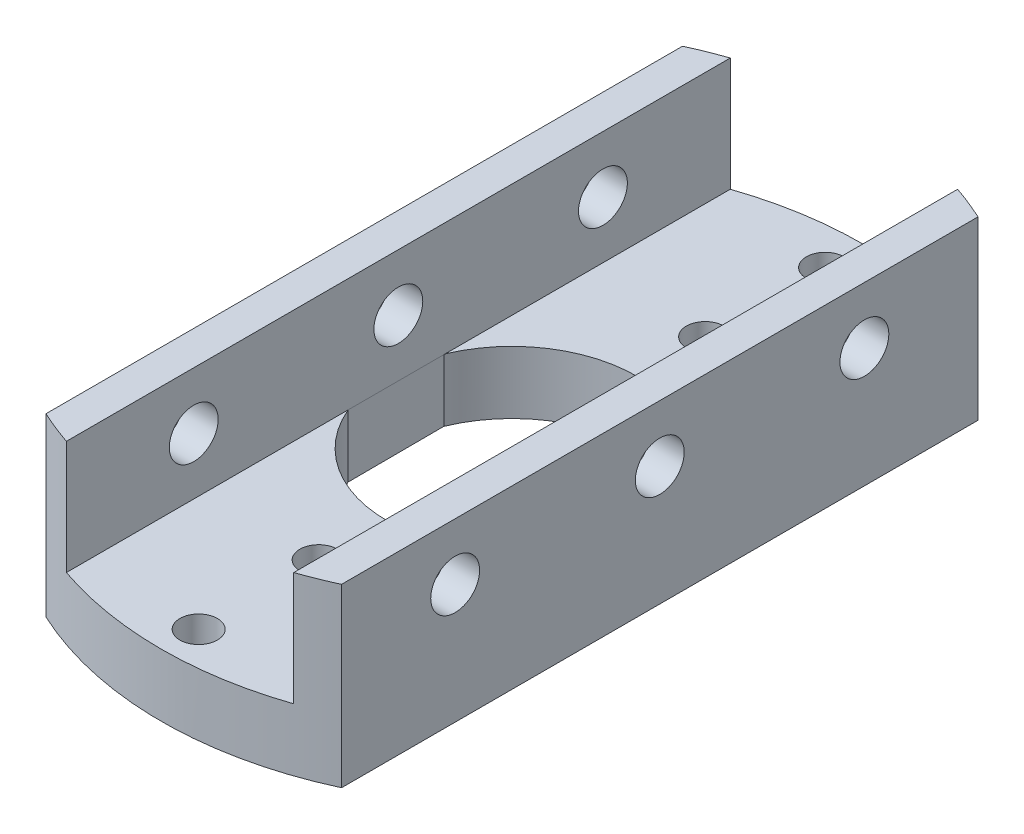
ISO-10303-21;
HEADER;
FILE_DESCRIPTION(('STEP AP214'),'2;1');
FILE_NAME('part.step','',(''),(''),'','','');
FILE_SCHEMA(('AUTOMOTIVE_DESIGN { 1 0 10303 214 1 1 1 1 }'));
ENDSEC;
DATA;
#1=APPLICATION_CONTEXT('core data for automotive mechanical design processes');
#2=APPLICATION_PROTOCOL_DEFINITION('international standard','automotive_design',2000,#1);
#3=PRODUCT_CONTEXT('',#1,'mechanical');
#4=PRODUCT('Part','Part','',(#3));
#5=PRODUCT_RELATED_PRODUCT_CATEGORY('part','',(#4));
#6=PRODUCT_DEFINITION_FORMATION('','',#4);
#7=PRODUCT_DEFINITION_CONTEXT('part definition',#1,'design');
#8=PRODUCT_DEFINITION('design','',#6,#7);
#9=PRODUCT_DEFINITION_SHAPE('','',#8);
#10=(LENGTH_UNIT() NAMED_UNIT(*) SI_UNIT(.MILLI.,.METRE.));
#11=(NAMED_UNIT(*) PLANE_ANGLE_UNIT() SI_UNIT($,.RADIAN.));
#12=(NAMED_UNIT(*) SI_UNIT($,.STERADIAN.) SOLID_ANGLE_UNIT());
#13=UNCERTAINTY_MEASURE_WITH_UNIT(LENGTH_MEASURE(1.E-05),#10,'distance_accuracy_value','');
#14=(GEOMETRIC_REPRESENTATION_CONTEXT(3) GLOBAL_UNCERTAINTY_ASSIGNED_CONTEXT((#13)) GLOBAL_UNIT_ASSIGNED_CONTEXT((#10,
#11,#12)) REPRESENTATION_CONTEXT('',''));
#15=CARTESIAN_POINT('',(0.,0.,0.));
#16=DIRECTION('',(0.,0.,1.));
#17=DIRECTION('',(1.,0.,0.));
#18=AXIS2_PLACEMENT_3D('',#15,#16,#17);
#19=CARTESIAN_POINT('',(20.,3.,-12.5));
#20=DIRECTION('',(0.,1.,0.));
#21=DIRECTION('',(0.,0.,1.));
#22=AXIS2_PLACEMENT_3D('',#19,#20,#21);
#23=PLANE('',#22);
#24=CARTESIAN_POINT('',(24.6387831341215,3.,-12.3520800029353));
#25=DIRECTION('',(0.,1.,0.));
#26=DIRECTION('',(0.,0.,1.));
#27=AXIS2_PLACEMENT_3D('',#24,#25,#26);
#28=CIRCLE('',#27,11.);
#29=CARTESIAN_POINT('',(14.4999999999997,3.,-8.08533926095814));
#30=VERTEX_POINT('',#29);
#31=CARTESIAN_POINT('',(34.4999999999997,3.,-7.4780260512315));
#32=VERTEX_POINT('',#31);
#33=EDGE_CURVE('E60',#30,#32,#28,.T.);
#34=ORIENTED_EDGE('',*,*,#33,.F.);
#35=DIRECTION('',(0.,0.,1.));
#36=VECTOR('',#35,1.);
#37=CARTESIAN_POINT('',(14.4999999999997,3.,0.));
#38=LINE('',#37,#36);
#39=CARTESIAN_POINT('',(14.4999999999997,3.,16.7018835008975));
#40=VERTEX_POINT('',#39);
#41=EDGE_CURVE('E183',#30,#40,#38,.T.);
#42=ORIENTED_EDGE('',*,*,#41,.T.);
#43=CARTESIAN_POINT('',(24.4999999999997,3.,-12.5));
#44=DIRECTION('',(0.,1.,0.));
#45=DIRECTION('',(0.,0.,1.));
#46=AXIS2_PLACEMENT_3D('',#43,#44,#45);
#47=CIRCLE('',#46,30.8666486681012);
#48=CARTESIAN_POINT('',(34.4999999999997,3.,16.7018835008975));
#49=VERTEX_POINT('',#48);
#50=EDGE_CURVE('E208',#40,#49,#47,.T.);
#51=ORIENTED_EDGE('',*,*,#50,.T.);
#52=DIRECTION('',(0.,0.,-1.));
#53=VECTOR('',#52,1.);
#54=CARTESIAN_POINT('',(34.4999999999997,3.,0.));
#55=LINE('',#54,#53);
#56=EDGE_CURVE('E167',#49,#32,#55,.T.);
#57=ORIENTED_EDGE('',*,*,#56,.T.);
#58=EDGE_LOOP('',(#34,#42,#51,#57));
#59=FACE_BOUND('',#58,.T.);
#60=CARTESIAN_POINT('',(24.6387831341225,3.,4.64791999706471));
#61=DIRECTION('',(0.,1.,0.));
#62=DIRECTION('',(0.,0.,1.));
#63=AXIS2_PLACEMENT_3D('',#60,#61,#62);
#64=CIRCLE('',#63,1.65);
#65=CARTESIAN_POINT('',(24.6387831341225,3.,6.29791999706471));
#66=VERTEX_POINT('',#65);
#67=EDGE_CURVE('E215',#66,#66,#64,.T.);
#68=ORIENTED_EDGE('',*,*,#67,.F.);
#69=EDGE_LOOP('',(#68));
#70=FACE_BOUND('',#69,.T.);
#71=CARTESIAN_POINT('',(24.6387831341247,3.,15.2045940706033));
#72=DIRECTION('',(0.,1.,0.));
#73=DIRECTION('',(0.,0.,1.));
#74=AXIS2_PLACEMENT_3D('',#71,#72,#73);
#75=CIRCLE('',#74,1.65);
#76=CARTESIAN_POINT('',(24.6387831341247,3.,16.8545940706033));
#77=VERTEX_POINT('',#76);
#78=EDGE_CURVE('E211',#77,#77,#75,.T.);
#79=ORIENTED_EDGE('',*,*,#78,.F.);
#80=EDGE_LOOP('',(#79));
#81=FACE_BOUND('',#80,.T.);
#82=ADVANCED_FACE('F45',(#59,#70,#81),#23,.T.);
#83=CARTESIAN_POINT('',(24.6387831341215,3.,-12.3520800029353));
#84=DIRECTION('',(0.,1.,0.));
#85=DIRECTION('',(0.,0.,1.));
#86=AXIS2_PLACEMENT_3D('',#83,#84,#85);
#87=CIRCLE('',#86,11.);
#88=CARTESIAN_POINT('',(34.4999999999997,3.,-17.2261339546391));
#89=VERTEX_POINT('',#88);
#90=CARTESIAN_POINT('',(14.4999999999997,3.,-16.6188207449124));
#91=VERTEX_POINT('',#90);
#92=EDGE_CURVE('E141',#89,#91,#87,.T.);
#93=ORIENTED_EDGE('',*,*,#92,.F.);
#94=CARTESIAN_POINT('',(34.4999999999997,3.,-41.7018835008975));
#95=VERTEX_POINT('',#94);
#96=EDGE_CURVE('E154',#89,#95,#55,.T.);
#97=ORIENTED_EDGE('',*,*,#96,.T.);
#98=CARTESIAN_POINT('',(14.4999999999997,3.,-41.7018835008975));
#99=VERTEX_POINT('',#98);
#100=EDGE_CURVE('E206',#95,#99,#47,.T.);
#101=ORIENTED_EDGE('',*,*,#100,.T.);
#102=EDGE_CURVE('E157',#99,#91,#38,.T.);
#103=ORIENTED_EDGE('',*,*,#102,.T.);
#104=EDGE_LOOP('',(#93,#97,#101,#103));
#105=FACE_BOUND('',#104,.T.);
#106=CARTESIAN_POINT('',(24.6387831341247,3.,-39.9087540764739));
#107=DIRECTION('',(0.,1.,0.));
#108=DIRECTION('',(0.,0.,1.));
#109=AXIS2_PLACEMENT_3D('',#106,#107,#108);
#110=CIRCLE('',#109,1.65);
#111=CARTESIAN_POINT('',(24.6387831341247,3.,-38.2587540764739));
#112=VERTEX_POINT('',#111);
#113=EDGE_CURVE('E214',#112,#112,#110,.T.);
#114=ORIENTED_EDGE('',*,*,#113,.F.);
#115=EDGE_LOOP('',(#114));
#116=FACE_BOUND('',#115,.T.);
#117=CARTESIAN_POINT('',(24.6387831341215,3.,-29.3520800029353));
#118=DIRECTION('',(0.,1.,0.));
#119=DIRECTION('',(0.,0.,1.));
#120=AXIS2_PLACEMENT_3D('',#117,#118,#119);
#121=CIRCLE('',#120,1.65);
#122=CARTESIAN_POINT('',(24.6387831341215,3.,-27.7020800029353));
#123=VERTEX_POINT('',#122);
#124=EDGE_CURVE('E202',#123,#123,#121,.T.);
#125=ORIENTED_EDGE('',*,*,#124,.F.);
#126=EDGE_LOOP('',(#125));
#127=FACE_BOUND('',#126,.T.);
#128=ADVANCED_FACE('F152',(#105,#116,#127),#23,.T.);
#129=CARTESIAN_POINT('',(24.6387831341215,-36.,-29.3520800029353));
#130=DIRECTION('',(0.,1.,0.));
#131=DIRECTION('',(0.,0.,1.));
#132=AXIS2_PLACEMENT_3D('',#129,#130,#131);
#133=CYLINDRICAL_SURFACE('',#132,1.65);
#134=ORIENTED_EDGE('',*,*,#124,.T.);
#135=EDGE_LOOP('',(#134));
#136=FACE_BOUND('',#135,.T.);
#137=CARTESIAN_POINT('',(24.6387831341215,-2.5,-29.3520800029353));
#138=DIRECTION('',(0.,-1.,0.));
#139=DIRECTION('',(0.,0.,-1.));
#140=AXIS2_PLACEMENT_3D('',#137,#138,#139);
#141=CIRCLE('',#140,1.65);
#142=CARTESIAN_POINT('',(24.6387831341215,-2.5,-31.0020800029353));
#143=VERTEX_POINT('',#142);
#144=EDGE_CURVE('E262',#143,#143,#141,.T.);
#145=ORIENTED_EDGE('',*,*,#144,.T.);
#146=EDGE_LOOP('',(#145));
#147=FACE_BOUND('',#146,.T.);
#148=ADVANCED_FACE('F361',(#136,#147),#133,.F.);
#149=CARTESIAN_POINT('',(24.6387831341225,-36.,4.64791999706471));
#150=DIRECTION('',(0.,1.,0.));
#151=DIRECTION('',(0.,0.,1.));
#152=AXIS2_PLACEMENT_3D('',#149,#150,#151);
#153=CYLINDRICAL_SURFACE('',#152,1.65);
#154=ORIENTED_EDGE('',*,*,#67,.T.);
#155=EDGE_LOOP('',(#154));
#156=FACE_BOUND('',#155,.T.);
#157=CARTESIAN_POINT('',(24.6387831341225,-2.5,4.64791999706471));
#158=DIRECTION('',(0.,-1.,0.));
#159=DIRECTION('',(0.,0.,-1.));
#160=AXIS2_PLACEMENT_3D('',#157,#158,#159);
#161=CIRCLE('',#160,1.65);
#162=CARTESIAN_POINT('',(24.6387831341225,-2.5,2.99791999706471));
#163=VERTEX_POINT('',#162);
#164=EDGE_CURVE('E265',#163,#163,#161,.T.);
#165=ORIENTED_EDGE('',*,*,#164,.T.);
#166=EDGE_LOOP('',(#165));
#167=FACE_BOUND('',#166,.T.);
#168=ADVANCED_FACE('F350',(#156,#167),#153,.F.);
#169=CARTESIAN_POINT('',(24.6387831341247,-36.,15.2045940706033));
#170=DIRECTION('',(0.,1.,0.));
#171=DIRECTION('',(0.,0.,1.));
#172=AXIS2_PLACEMENT_3D('',#169,#170,#171);
#173=CYLINDRICAL_SURFACE('',#172,1.65);
#174=ORIENTED_EDGE('',*,*,#78,.T.);
#175=EDGE_LOOP('',(#174));
#176=FACE_BOUND('',#175,.T.);
#177=CARTESIAN_POINT('',(24.6387831341247,-2.5,15.2045940706033));
#178=DIRECTION('',(0.,-1.,0.));
#179=DIRECTION('',(0.,0.,-1.));
#180=AXIS2_PLACEMENT_3D('',#177,#178,#179);
#181=CIRCLE('',#180,1.65);
#182=CARTESIAN_POINT('',(24.6387831341247,-2.5,13.5545940706033));
#183=VERTEX_POINT('',#182);
#184=EDGE_CURVE('E268',#183,#183,#181,.T.);
#185=ORIENTED_EDGE('',*,*,#184,.T.);
#186=EDGE_LOOP('',(#185));
#187=FACE_BOUND('',#186,.T.);
#188=ADVANCED_FACE('F346',(#176,#187),#173,.F.);
#189=CARTESIAN_POINT('',(24.6387831341247,-36.,-39.9087540764739));
#190=DIRECTION('',(0.,1.,0.));
#191=DIRECTION('',(0.,0.,1.));
#192=AXIS2_PLACEMENT_3D('',#189,#190,#191);
#193=CYLINDRICAL_SURFACE('',#192,1.65);
#194=ORIENTED_EDGE('',*,*,#113,.T.);
#195=EDGE_LOOP('',(#194));
#196=FACE_BOUND('',#195,.T.);
#197=CARTESIAN_POINT('',(24.6387831341247,0.,-39.9087540764739));
#198=DIRECTION('',(0.,1.,0.));
#199=DIRECTION('',(0.,0.,1.));
#200=AXIS2_PLACEMENT_3D('',#197,#198,#199);
#201=CIRCLE('',#200,1.65);
#202=CARTESIAN_POINT('',(24.6387831341247,0.,-38.2587540764739));
#203=VERTEX_POINT('',#202);
#204=EDGE_CURVE('E203',#203,#203,#201,.T.);
#205=ORIENTED_EDGE('',*,*,#204,.F.);
#206=EDGE_LOOP('',(#205));
#207=FACE_BOUND('',#206,.T.);
#208=ADVANCED_FACE('F349',(#196,#207),#193,.F.);
#209=CARTESIAN_POINT('',(24.4999999999997,-36.,-12.5));
#210=DIRECTION('',(0.,1.,0.));
#211=DIRECTION('',(0.,0.,1.));
#212=AXIS2_PLACEMENT_3D('',#209,#210,#211);
#213=CYLINDRICAL_SURFACE('',#212,30.8666486681012);
#214=DIRECTION('',(0.,-1.,0.));
#215=VECTOR('',#214,1.);
#216=CARTESIAN_POINT('',(11.4999999999997,84.,15.4955353583387));
#217=LINE('',#216,#215);
#218=CARTESIAN_POINT('',(11.4999999999997,13.,15.4955353583387));
#219=VERTEX_POINT('',#218);
#220=CARTESIAN_POINT('',(11.4999999999997,-2.5,15.4955353583387));
#221=VERTEX_POINT('',#220);
#222=EDGE_CURVE('E218',#219,#221,#217,.T.);
#223=ORIENTED_EDGE('',*,*,#222,.T.);
#224=CARTESIAN_POINT('',(24.4999999999997,-2.5,-12.5000000000017));
#225=DIRECTION('',(0.,-1.,0.));
#226=DIRECTION('',(0.,0.,1.));
#227=AXIS2_PLACEMENT_3D('',#224,#225,#226);
#228=CIRCLE('',#227,30.8666486681027);
#229=CARTESIAN_POINT('',(37.4999999999997,-2.5,15.4955353583387));
#230=VERTEX_POINT('',#229);
#231=EDGE_CURVE('E271',#230,#221,#228,.T.);
#232=ORIENTED_EDGE('',*,*,#231,.F.);
#233=DIRECTION('',(0.,-1.,0.));
#234=VECTOR('',#233,1.);
#235=CARTESIAN_POINT('',(37.4999999999997,84.,15.4955353583387));
#236=LINE('',#235,#234);
#237=CARTESIAN_POINT('',(37.4999999999997,13.,15.4955353583387));
#238=VERTEX_POINT('',#237);
#239=EDGE_CURVE('E210',#238,#230,#236,.T.);
#240=ORIENTED_EDGE('',*,*,#239,.F.);
#241=CARTESIAN_POINT('',(24.4999999999997,13.,-12.5));
#242=DIRECTION('',(0.,1.,0.));
#243=DIRECTION('',(0.,0.,1.));
#244=AXIS2_PLACEMENT_3D('',#241,#242,#243);
#245=CIRCLE('',#244,30.8666486681012);
#246=CARTESIAN_POINT('',(34.4999999999997,13.,16.7018835008975));
#247=VERTEX_POINT('',#246);
#248=EDGE_CURVE('E301',#247,#238,#245,.T.);
#249=ORIENTED_EDGE('',*,*,#248,.F.);
#250=DIRECTION('',(0.,-1.,0.));
#251=VECTOR('',#250,1.);
#252=CARTESIAN_POINT('',(34.4999999999997,13.,16.7018835008975));
#253=LINE('',#252,#251);
#254=EDGE_CURVE('E180',#247,#49,#253,.T.);
#255=ORIENTED_EDGE('',*,*,#254,.T.);
#256=ORIENTED_EDGE('',*,*,#50,.F.);
#257=DIRECTION('',(0.,-1.,0.));
#258=VECTOR('',#257,1.);
#259=CARTESIAN_POINT('',(14.4999999999997,13.,16.7018835008975));
#260=LINE('',#259,#258);
#261=CARTESIAN_POINT('',(14.4999999999997,13.,16.7018835008975));
#262=VERTEX_POINT('',#261);
#263=EDGE_CURVE('E195',#262,#40,#260,.T.);
#264=ORIENTED_EDGE('',*,*,#263,.F.);
#265=CARTESIAN_POINT('',(24.4999999999997,13.,-12.5));
#266=DIRECTION('',(0.,1.,0.));
#267=DIRECTION('',(0.,0.,1.));
#268=AXIS2_PLACEMENT_3D('',#265,#266,#267);
#269=CIRCLE('',#268,30.8666486681012);
#270=EDGE_CURVE('E193',#219,#262,#269,.T.);
#271=ORIENTED_EDGE('',*,*,#270,.F.);
#272=EDGE_LOOP('',(#223,#232,#240,#249,#255,#256,#264,#271));
#273=FACE_BOUND('',#272,.T.);
#274=ADVANCED_FACE('F315',(#273),#213,.T.);
#275=DIRECTION('',(0.,-1.,0.));
#276=VECTOR('',#275,1.);
#277=CARTESIAN_POINT('',(11.4999999999997,84.,-40.4955353583387));
#278=LINE('',#277,#276);
#279=CARTESIAN_POINT('',(11.4999999999997,13.,-40.4955353583387));
#280=VERTEX_POINT('',#279);
#281=CARTESIAN_POINT('',(11.4999999999997,-2.5,-40.4955353583387));
#282=VERTEX_POINT('',#281);
#283=EDGE_CURVE('E225',#280,#282,#278,.T.);
#284=ORIENTED_EDGE('',*,*,#283,.F.);
#285=CARTESIAN_POINT('',(24.4999999999997,13.,-12.5));
#286=DIRECTION('',(0.,1.,0.));
#287=DIRECTION('',(0.,0.,1.));
#288=AXIS2_PLACEMENT_3D('',#285,#286,#287);
#289=CIRCLE('',#288,30.8666486681012);
#290=CARTESIAN_POINT('',(14.4999999999997,13.,-41.7018835008975));
#291=VERTEX_POINT('',#290);
#292=EDGE_CURVE('E187',#291,#280,#289,.T.);
#293=ORIENTED_EDGE('',*,*,#292,.F.);
#294=DIRECTION('',(0.,-1.,0.));
#295=VECTOR('',#294,1.);
#296=CARTESIAN_POINT('',(14.4999999999997,13.,-41.7018835008975));
#297=LINE('',#296,#295);
#298=EDGE_CURVE('E199',#291,#99,#297,.T.);
#299=ORIENTED_EDGE('',*,*,#298,.T.);
#300=ORIENTED_EDGE('',*,*,#100,.F.);
#301=DIRECTION('',(0.,-1.,0.));
#302=VECTOR('',#301,1.);
#303=CARTESIAN_POINT('',(34.4999999999997,13.,-41.7018835008975));
#304=LINE('',#303,#302);
#305=CARTESIAN_POINT('',(34.4999999999997,13.,-41.7018835008975));
#306=VERTEX_POINT('',#305);
#307=EDGE_CURVE('E166',#306,#95,#304,.T.);
#308=ORIENTED_EDGE('',*,*,#307,.F.);
#309=CARTESIAN_POINT('',(24.4999999999997,13.,-12.5));
#310=DIRECTION('',(0.,1.,0.));
#311=DIRECTION('',(0.,0.,1.));
#312=AXIS2_PLACEMENT_3D('',#309,#310,#311);
#313=CIRCLE('',#312,30.8666486681012);
#314=CARTESIAN_POINT('',(37.4999999999998,13.,-40.4955353583387));
#315=VERTEX_POINT('',#314);
#316=EDGE_CURVE('E177',#315,#306,#313,.T.);
#317=ORIENTED_EDGE('',*,*,#316,.F.);
#318=DIRECTION('',(0.,-1.,0.));
#319=VECTOR('',#318,1.);
#320=CARTESIAN_POINT('',(37.4999999999998,84.,-40.4955353583387));
#321=LINE('',#320,#319);
#322=CARTESIAN_POINT('',(37.4999999999998,-2.5,-40.4955353583387));
#323=VERTEX_POINT('',#322);
#324=EDGE_CURVE('E207',#315,#323,#321,.T.);
#325=ORIENTED_EDGE('',*,*,#324,.T.);
#326=CARTESIAN_POINT('',(24.4999999999997,-2.5,-12.4999999999997));
#327=DIRECTION('',(0.,-1.,0.));
#328=DIRECTION('',(0.,0.,-1.));
#329=AXIS2_PLACEMENT_3D('',#326,#327,#328);
#330=CIRCLE('',#329,30.8666486681014);
#331=EDGE_CURVE('E277',#282,#323,#330,.T.);
#332=ORIENTED_EDGE('',*,*,#331,.F.);
#333=EDGE_LOOP('',(#284,#293,#299,#300,#308,#317,#325,#332));
#334=FACE_BOUND('',#333,.T.);
#335=ADVANCED_FACE('F311',(#334),#213,.T.);
#336=CARTESIAN_POINT('',(37.4999999999998,84.,-40.4955353583387));
#337=DIRECTION('',(1.,0.,0.));
#338=DIRECTION('',(0.,0.,-1.));
#339=AXIS2_PLACEMENT_3D('',#336,#337,#338);
#340=PLANE('',#339);
#341=CARTESIAN_POINT('',(37.4999999999997,8.,5.5));
#342=DIRECTION('',(1.,0.,0.));
#343=DIRECTION('',(0.,0.,-1.));
#344=AXIS2_PLACEMENT_3D('',#341,#342,#343);
#345=CIRCLE('',#344,2.15);
#346=CARTESIAN_POINT('',(37.4999999999997,8.,3.35));
#347=VERTEX_POINT('',#346);
#348=EDGE_CURVE('E168',#347,#347,#345,.F.);
#349=ORIENTED_EDGE('',*,*,#348,.T.);
#350=EDGE_LOOP('',(#349));
#351=FACE_BOUND('',#350,.T.);
#352=CARTESIAN_POINT('',(37.4999999999997,8.00000000000001,-12.5));
#353=DIRECTION('',(1.,0.,0.));
#354=DIRECTION('',(0.,0.,-1.));
#355=AXIS2_PLACEMENT_3D('',#352,#353,#354);
#356=CIRCLE('',#355,2.15);
#357=CARTESIAN_POINT('',(37.4999999999997,8.00000000000001,-14.65));
#358=VERTEX_POINT('',#357);
#359=EDGE_CURVE('E243',#358,#358,#356,.F.);
#360=ORIENTED_EDGE('',*,*,#359,.T.);
#361=EDGE_LOOP('',(#360));
#362=FACE_BOUND('',#361,.T.);
#363=CARTESIAN_POINT('',(37.4999999999998,8.00000000000001,-30.5));
#364=DIRECTION('',(1.,0.,0.));
#365=DIRECTION('',(0.,0.,-1.));
#366=AXIS2_PLACEMENT_3D('',#363,#364,#365);
#367=CIRCLE('',#366,2.15);
#368=CARTESIAN_POINT('',(37.4999999999998,8.00000000000001,-32.65));
#369=VERTEX_POINT('',#368);
#370=EDGE_CURVE('E238',#369,#369,#367,.F.);
#371=ORIENTED_EDGE('',*,*,#370,.T.);
#372=EDGE_LOOP('',(#371));
#373=FACE_BOUND('',#372,.T.);
#374=ORIENTED_EDGE('',*,*,#239,.T.);
#375=DIRECTION('',(0.,0.,1.));
#376=VECTOR('',#375,1.);
#377=CARTESIAN_POINT('',(37.4999999999997,-2.5,15.4955353583387));
#378=LINE('',#377,#376);
#379=EDGE_CURVE('E233',#323,#230,#378,.T.);
#380=ORIENTED_EDGE('',*,*,#379,.F.);
#381=ORIENTED_EDGE('',*,*,#324,.F.);
#382=DIRECTION('',(0.,0.,-1.));
#383=VECTOR('',#382,1.);
#384=CARTESIAN_POINT('',(37.4999999999998,13.,0.));
#385=LINE('',#384,#383);
#386=EDGE_CURVE('E303',#238,#315,#385,.T.);
#387=ORIENTED_EDGE('',*,*,#386,.F.);
#388=EDGE_LOOP('',(#374,#380,#381,#387));
#389=FACE_BOUND('',#388,.T.);
#390=ADVANCED_FACE('F318',(#351,#362,#373,#389),#340,.T.);
#391=CARTESIAN_POINT('',(11.4999999999997,84.,-40.4955353583387));
#392=DIRECTION('',(-1.,0.,0.));
#393=DIRECTION('',(0.,0.,1.));
#394=AXIS2_PLACEMENT_3D('',#391,#392,#393);
#395=PLANE('',#394);
#396=CARTESIAN_POINT('',(11.4999999999997,8.,5.5));
#397=DIRECTION('',(-1.,0.,0.));
#398=DIRECTION('',(0.,0.,1.));
#399=AXIS2_PLACEMENT_3D('',#396,#397,#398);
#400=CIRCLE('',#399,2.15);
#401=CARTESIAN_POINT('',(11.4999999999997,8.,7.65));
#402=VERTEX_POINT('',#401);
#403=EDGE_CURVE('E173',#402,#402,#400,.F.);
#404=ORIENTED_EDGE('',*,*,#403,.T.);
#405=EDGE_LOOP('',(#404));
#406=FACE_BOUND('',#405,.T.);
#407=CARTESIAN_POINT('',(11.4999999999997,8.00000000000001,-12.5));
#408=DIRECTION('',(-1.,0.,0.));
#409=DIRECTION('',(0.,0.,1.));
#410=AXIS2_PLACEMENT_3D('',#407,#408,#409);
#411=CIRCLE('',#410,2.15);
#412=CARTESIAN_POINT('',(11.4999999999997,8.00000000000001,-10.35));
#413=VERTEX_POINT('',#412);
#414=EDGE_CURVE('E291',#413,#413,#411,.F.);
#415=ORIENTED_EDGE('',*,*,#414,.T.);
#416=EDGE_LOOP('',(#415));
#417=FACE_BOUND('',#416,.T.);
#418=CARTESIAN_POINT('',(11.4999999999997,8.00000000000001,-30.5));
#419=DIRECTION('',(-1.,0.,0.));
#420=DIRECTION('',(0.,0.,1.));
#421=AXIS2_PLACEMENT_3D('',#418,#419,#420);
#422=CIRCLE('',#421,2.15);
#423=CARTESIAN_POINT('',(11.4999999999997,8.00000000000001,-28.35));
#424=VERTEX_POINT('',#423);
#425=EDGE_CURVE('E284',#424,#424,#422,.F.);
#426=ORIENTED_EDGE('',*,*,#425,.T.);
#427=EDGE_LOOP('',(#426));
#428=FACE_BOUND('',#427,.T.);
#429=ORIENTED_EDGE('',*,*,#283,.T.);
#430=DIRECTION('',(0.,0.,-1.));
#431=VECTOR('',#430,1.);
#432=CARTESIAN_POINT('',(11.4999999999997,-2.5,15.4955353583387));
#433=LINE('',#432,#431);
#434=EDGE_CURVE('E274',#221,#282,#433,.T.);
#435=ORIENTED_EDGE('',*,*,#434,.F.);
#436=ORIENTED_EDGE('',*,*,#222,.F.);
#437=DIRECTION('',(0.,0.,1.));
#438=VECTOR('',#437,1.);
#439=CARTESIAN_POINT('',(11.4999999999997,13.,0.));
#440=LINE('',#439,#438);
#441=EDGE_CURVE('E190',#280,#219,#440,.T.);
#442=ORIENTED_EDGE('',*,*,#441,.F.);
#443=EDGE_LOOP('',(#429,#435,#436,#442));
#444=FACE_BOUND('',#443,.T.);
#445=ADVANCED_FACE('F47',(#406,#417,#428,#444),#395,.T.);
#446=CARTESIAN_POINT('',(14.4999999999997,13.,0.));
#447=DIRECTION('',(1.,0.,0.));
#448=DIRECTION('',(0.,0.,-1.));
#449=AXIS2_PLACEMENT_3D('',#446,#447,#448);
#450=PLANE('',#449);
#451=CARTESIAN_POINT('',(14.4999999999997,8.,5.5));
#452=DIRECTION('',(1.,0.,0.));
#453=DIRECTION('',(0.,0.,-1.));
#454=AXIS2_PLACEMENT_3D('',#451,#452,#453);
#455=CIRCLE('',#454,2.15);
#456=CARTESIAN_POINT('',(14.4999999999997,8.,3.35));
#457=VERTEX_POINT('',#456);
#458=EDGE_CURVE('E242',#457,#457,#455,.F.);
#459=ORIENTED_EDGE('',*,*,#458,.T.);
#460=EDGE_LOOP('',(#459));
#461=FACE_BOUND('',#460,.T.);
#462=CARTESIAN_POINT('',(14.4999999999997,8.00000000000001,-12.5));
#463=DIRECTION('',(1.,0.,0.));
#464=DIRECTION('',(0.,0.,-1.));
#465=AXIS2_PLACEMENT_3D('',#462,#463,#464);
#466=CIRCLE('',#465,2.15);
#467=CARTESIAN_POINT('',(14.4999999999997,8.00000000000001,-14.65));
#468=VERTEX_POINT('',#467);
#469=EDGE_CURVE('E237',#468,#468,#466,.F.);
#470=ORIENTED_EDGE('',*,*,#469,.T.);
#471=EDGE_LOOP('',(#470));
#472=FACE_BOUND('',#471,.T.);
#473=CARTESIAN_POINT('',(14.4999999999997,8.00000000000001,-30.5));
#474=DIRECTION('',(1.,0.,0.));
#475=DIRECTION('',(0.,0.,-1.));
#476=AXIS2_PLACEMENT_3D('',#473,#474,#475);
#477=CIRCLE('',#476,2.15);
#478=CARTESIAN_POINT('',(14.4999999999997,8.00000000000001,-32.65));
#479=VERTEX_POINT('',#478);
#480=EDGE_CURVE('E232',#479,#479,#477,.F.);
#481=ORIENTED_EDGE('',*,*,#480,.T.);
#482=EDGE_LOOP('',(#481));
#483=FACE_BOUND('',#482,.T.);
#484=ORIENTED_EDGE('',*,*,#102,.F.);
#485=ORIENTED_EDGE('',*,*,#298,.F.);
#486=DIRECTION('',(0.,0.,1.));
#487=VECTOR('',#486,1.);
#488=CARTESIAN_POINT('',(14.4999999999997,13.,0.));
#489=LINE('',#488,#487);
#490=EDGE_CURVE('E184',#291,#262,#489,.T.);
#491=ORIENTED_EDGE('',*,*,#490,.T.);
#492=ORIENTED_EDGE('',*,*,#263,.T.);
#493=ORIENTED_EDGE('',*,*,#41,.F.);
#494=DIRECTION('',(0.,0.,1.));
#495=VECTOR('',#494,1.);
#496=CARTESIAN_POINT('',(14.4999999999997,3.,0.));
#497=LINE('',#496,#495);
#498=EDGE_CURVE('E256',#91,#30,#497,.T.);
#499=ORIENTED_EDGE('',*,*,#498,.F.);
#500=EDGE_LOOP('',(#484,#485,#491,#492,#493,#499));
#501=FACE_BOUND('',#500,.T.);
#502=ADVANCED_FACE('F332',(#461,#472,#483,#501),#450,.T.);
#503=CARTESIAN_POINT('',(0.,13.,0.));
#504=DIRECTION('',(0.,1.,0.));
#505=DIRECTION('',(0.,0.,1.));
#506=AXIS2_PLACEMENT_3D('',#503,#504,#505);
#507=PLANE('',#506);
#508=ORIENTED_EDGE('',*,*,#490,.F.);
#509=ORIENTED_EDGE('',*,*,#292,.T.);
#510=ORIENTED_EDGE('',*,*,#441,.T.);
#511=ORIENTED_EDGE('',*,*,#270,.T.);
#512=EDGE_LOOP('',(#508,#509,#510,#511));
#513=FACE_BOUND('',#512,.T.);
#514=ADVANCED_FACE('F328',(#513),#507,.T.);
#515=CARTESIAN_POINT('',(34.4999999999997,13.,0.));
#516=DIRECTION('',(-1.,0.,0.));
#517=DIRECTION('',(0.,0.,1.));
#518=AXIS2_PLACEMENT_3D('',#515,#516,#517);
#519=PLANE('',#518);
#520=CARTESIAN_POINT('',(34.4999999999997,8.,5.5));
#521=DIRECTION('',(-1.,0.,0.));
#522=DIRECTION('',(0.,0.,1.));
#523=AXIS2_PLACEMENT_3D('',#520,#521,#522);
#524=CIRCLE('',#523,2.15);
#525=CARTESIAN_POINT('',(34.4999999999997,8.,7.65));
#526=VERTEX_POINT('',#525);
#527=EDGE_CURVE('E239',#526,#526,#524,.F.);
#528=ORIENTED_EDGE('',*,*,#527,.T.);
#529=EDGE_LOOP('',(#528));
#530=FACE_BOUND('',#529,.T.);
#531=CARTESIAN_POINT('',(34.4999999999997,8.00000000000001,-12.5));
#532=DIRECTION('',(-1.,0.,0.));
#533=DIRECTION('',(0.,0.,1.));
#534=AXIS2_PLACEMENT_3D('',#531,#532,#533);
#535=CIRCLE('',#534,2.15);
#536=CARTESIAN_POINT('',(34.4999999999997,8.00000000000001,-10.35));
#537=VERTEX_POINT('',#536);
#538=EDGE_CURVE('E234',#537,#537,#535,.F.);
#539=ORIENTED_EDGE('',*,*,#538,.T.);
#540=EDGE_LOOP('',(#539));
#541=FACE_BOUND('',#540,.T.);
#542=CARTESIAN_POINT('',(34.4999999999997,8.00000000000001,-30.5));
#543=DIRECTION('',(-1.,0.,0.));
#544=DIRECTION('',(0.,0.,1.));
#545=AXIS2_PLACEMENT_3D('',#542,#543,#544);
#546=CIRCLE('',#545,2.15);
#547=CARTESIAN_POINT('',(34.4999999999997,8.00000000000001,-28.35));
#548=VERTEX_POINT('',#547);
#549=EDGE_CURVE('E229',#548,#548,#546,.F.);
#550=ORIENTED_EDGE('',*,*,#549,.T.);
#551=EDGE_LOOP('',(#550));
#552=FACE_BOUND('',#551,.T.);
#553=ORIENTED_EDGE('',*,*,#56,.F.);
#554=ORIENTED_EDGE('',*,*,#254,.F.);
#555=DIRECTION('',(0.,0.,-1.));
#556=VECTOR('',#555,1.);
#557=CARTESIAN_POINT('',(34.4999999999997,13.,0.));
#558=LINE('',#557,#556);
#559=EDGE_CURVE('E171',#247,#306,#558,.T.);
#560=ORIENTED_EDGE('',*,*,#559,.T.);
#561=ORIENTED_EDGE('',*,*,#307,.T.);
#562=ORIENTED_EDGE('',*,*,#96,.F.);
#563=DIRECTION('',(0.,1.,0.));
#564=VECTOR('',#563,1.);
#565=CARTESIAN_POINT('',(34.4999999999997,-7.,-17.2261339546391));
#566=LINE('',#565,#564);
#567=CARTESIAN_POINT('',(34.4999999999997,-2.5,-17.2261339546391));
#568=VERTEX_POINT('',#567);
#569=EDGE_CURVE('E68',#568,#89,#566,.T.);
#570=ORIENTED_EDGE('',*,*,#569,.F.);
#571=DIRECTION('',(0.,0.,-1.));
#572=VECTOR('',#571,1.);
#573=CARTESIAN_POINT('',(34.4999999999997,-2.5,-12.5000000000017));
#574=LINE('',#573,#572);
#575=CARTESIAN_POINT('',(34.4999999999997,-2.5,-7.4780260512315));
#576=VERTEX_POINT('',#575);
#577=EDGE_CURVE('E228',#576,#568,#574,.T.);
#578=ORIENTED_EDGE('',*,*,#577,.F.);
#579=DIRECTION('',(0.,1.,0.));
#580=VECTOR('',#579,1.);
#581=CARTESIAN_POINT('',(34.4999999999997,-7.,-7.4780260512315));
#582=LINE('',#581,#580);
#583=EDGE_CURVE('E148',#576,#32,#582,.T.);
#584=ORIENTED_EDGE('',*,*,#583,.T.);
#585=EDGE_LOOP('',(#553,#554,#560,#561,#562,#570,#578,#584));
#586=FACE_BOUND('',#585,.T.);
#587=ADVANCED_FACE('F163',(#530,#541,#552,#586),#519,.T.);
#588=CARTESIAN_POINT('',(0.,13.,0.));
#589=DIRECTION('',(0.,1.,0.));
#590=DIRECTION('',(0.,0.,1.));
#591=AXIS2_PLACEMENT_3D('',#588,#589,#590);
#592=PLANE('',#591);
#593=ORIENTED_EDGE('',*,*,#559,.F.);
#594=ORIENTED_EDGE('',*,*,#248,.T.);
#595=ORIENTED_EDGE('',*,*,#386,.T.);
#596=ORIENTED_EDGE('',*,*,#316,.T.);
#597=EDGE_LOOP('',(#593,#594,#595,#596));
#598=FACE_BOUND('',#597,.T.);
#599=ADVANCED_FACE('F309',(#598),#592,.T.);
#600=CARTESIAN_POINT('',(42.4999999999998,8.00000000000001,-30.5));
#601=DIRECTION('',(-1.,0.,0.));
#602=DIRECTION('',(0.,0.,1.));
#603=AXIS2_PLACEMENT_3D('',#600,#601,#602);
#604=CYLINDRICAL_SURFACE('',#603,2.15);
#605=ORIENTED_EDGE('',*,*,#370,.F.);
#606=EDGE_LOOP('',(#605));
#607=FACE_BOUND('',#606,.T.);
#608=ORIENTED_EDGE('',*,*,#549,.F.);
#609=EDGE_LOOP('',(#608));
#610=FACE_BOUND('',#609,.T.);
#611=ADVANCED_FACE('F387',(#607,#610),#604,.F.);
#612=CARTESIAN_POINT('',(42.4999999999998,8.00000000000001,-12.5));
#613=DIRECTION('',(-1.,0.,0.));
#614=DIRECTION('',(0.,0.,1.));
#615=AXIS2_PLACEMENT_3D('',#612,#613,#614);
#616=CYLINDRICAL_SURFACE('',#615,2.15);
#617=ORIENTED_EDGE('',*,*,#359,.F.);
#618=EDGE_LOOP('',(#617));
#619=FACE_BOUND('',#618,.T.);
#620=ORIENTED_EDGE('',*,*,#538,.F.);
#621=EDGE_LOOP('',(#620));
#622=FACE_BOUND('',#621,.T.);
#623=ADVANCED_FACE('F390',(#619,#622),#616,.F.);
#624=CARTESIAN_POINT('',(42.4999999999998,8.,5.5));
#625=DIRECTION('',(-1.,0.,0.));
#626=DIRECTION('',(0.,0.,1.));
#627=AXIS2_PLACEMENT_3D('',#624,#625,#626);
#628=CYLINDRICAL_SURFACE('',#627,2.15);
#629=ORIENTED_EDGE('',*,*,#348,.F.);
#630=EDGE_LOOP('',(#629));
#631=FACE_BOUND('',#630,.T.);
#632=ORIENTED_EDGE('',*,*,#527,.F.);
#633=EDGE_LOOP('',(#632));
#634=FACE_BOUND('',#633,.T.);
#635=ADVANCED_FACE('F430',(#631,#634),#628,.F.);
#636=ORIENTED_EDGE('',*,*,#425,.F.);
#637=EDGE_LOOP('',(#636));
#638=FACE_BOUND('',#637,.T.);
#639=ORIENTED_EDGE('',*,*,#480,.F.);
#640=EDGE_LOOP('',(#639));
#641=FACE_BOUND('',#640,.T.);
#642=ADVANCED_FACE('F392',(#638,#641),#604,.F.);
#643=ORIENTED_EDGE('',*,*,#414,.F.);
#644=EDGE_LOOP('',(#643));
#645=FACE_BOUND('',#644,.T.);
#646=ORIENTED_EDGE('',*,*,#469,.F.);
#647=EDGE_LOOP('',(#646));
#648=FACE_BOUND('',#647,.T.);
#649=ADVANCED_FACE('F427',(#645,#648),#616,.F.);
#650=ORIENTED_EDGE('',*,*,#403,.F.);
#651=EDGE_LOOP('',(#650));
#652=FACE_BOUND('',#651,.T.);
#653=ORIENTED_EDGE('',*,*,#458,.F.);
#654=EDGE_LOOP('',(#653));
#655=FACE_BOUND('',#654,.T.);
#656=ADVANCED_FACE('F422',(#652,#655),#628,.F.);
#657=CARTESIAN_POINT('',(24.4999999999997,0.,-12.5000000000017));
#658=DIRECTION('',(0.,1.,0.));
#659=DIRECTION('',(0.,0.,1.));
#660=AXIS2_PLACEMENT_3D('',#657,#658,#659);
#661=PLANE('',#660);
#662=ORIENTED_EDGE('',*,*,#204,.T.);
#663=EDGE_LOOP('',(#662));
#664=FACE_BOUND('',#663,.T.);
#665=ADVANCED_FACE('F355',(#664),#661,.T.);
#666=CARTESIAN_POINT('',(24.4999999999997,-2.5,-12.5000000000017));
#667=DIRECTION('',(0.,1.,0.));
#668=DIRECTION('',(0.,0.,1.));
#669=AXIS2_PLACEMENT_3D('',#666,#667,#668);
#670=PLANE('',#669);
#671=DIRECTION('',(0.0042203685169559,0.,0.999991094205134));
#672=VECTOR('',#671,1.);
#673=CARTESIAN_POINT('',(14.4815467858361,-2.5,-12.4577180589138));
#674=LINE('',#673,#672);
#675=CARTESIAN_POINT('',(14.4643470582249,-2.5,-16.5330907105864));
#676=VERTEX_POINT('',#675);
#677=CARTESIAN_POINT('',(14.4999999999997,-2.5,-8.08533926095814));
#678=VERTEX_POINT('',#677);
#679=EDGE_CURVE('E53',#676,#678,#674,.T.);
#680=ORIENTED_EDGE('',*,*,#679,.T.);
#681=CARTESIAN_POINT('',(24.6387831341215,-2.5,-12.3520800029353));
#682=DIRECTION('',(0.,1.,0.));
#683=DIRECTION('',(0.,0.,1.));
#684=AXIS2_PLACEMENT_3D('',#681,#682,#683);
#685=CIRCLE('',#684,11.);
#686=EDGE_CURVE('E12',#678,#576,#685,.T.);
#687=ORIENTED_EDGE('',*,*,#686,.T.);
#688=ORIENTED_EDGE('',*,*,#577,.T.);
#689=CARTESIAN_POINT('',(24.6387831341215,-2.5,-12.3520800029353));
#690=DIRECTION('',(0.,1.,0.));
#691=DIRECTION('',(0.,0.,1.));
#692=AXIS2_PLACEMENT_3D('',#689,#690,#691);
#693=CIRCLE('',#692,11.);
#694=EDGE_CURVE('E145',#568,#676,#693,.T.);
#695=ORIENTED_EDGE('',*,*,#694,.T.);
#696=EDGE_LOOP('',(#680,#687,#688,#695));
#697=FACE_BOUND('',#696,.T.);
#698=ORIENTED_EDGE('',*,*,#231,.T.);
#699=ORIENTED_EDGE('',*,*,#434,.T.);
#700=ORIENTED_EDGE('',*,*,#331,.T.);
#701=ORIENTED_EDGE('',*,*,#379,.T.);
#702=EDGE_LOOP('',(#698,#699,#700,#701));
#703=FACE_BOUND('',#702,.T.);
#704=ORIENTED_EDGE('',*,*,#184,.F.);
#705=EDGE_LOOP('',(#704));
#706=FACE_BOUND('',#705,.T.);
#707=ORIENTED_EDGE('',*,*,#164,.F.);
#708=EDGE_LOOP('',(#707));
#709=FACE_BOUND('',#708,.T.);
#710=ORIENTED_EDGE('',*,*,#144,.F.);
#711=EDGE_LOOP('',(#710));
#712=FACE_BOUND('',#711,.T.);
#713=ADVANCED_FACE('F247',(#697,#703,#706,#709,#712),#670,.F.);
#714=CARTESIAN_POINT('',(24.6387831341215,-7.,-12.3520800029353));
#715=DIRECTION('',(0.,1.,0.));
#716=DIRECTION('',(0.,0.,1.));
#717=AXIS2_PLACEMENT_3D('',#714,#715,#716);
#718=CYLINDRICAL_SURFACE('',#717,11.);
#719=DIRECTION('',(0.,1.,0.));
#720=VECTOR('',#719,1.);
#721=CARTESIAN_POINT('',(14.4999999999997,-7.,-8.08533926095814));
#722=LINE('',#721,#720);
#723=EDGE_CURVE('E253',#678,#30,#722,.T.);
#724=ORIENTED_EDGE('',*,*,#723,.T.);
#725=ORIENTED_EDGE('',*,*,#33,.T.);
#726=ORIENTED_EDGE('',*,*,#583,.F.);
#727=ORIENTED_EDGE('',*,*,#686,.F.);
#728=EDGE_LOOP('',(#724,#725,#726,#727));
#729=FACE_BOUND('',#728,.T.);
#730=ADVANCED_FACE('F336',(#729),#718,.F.);
#731=CARTESIAN_POINT('',(14.4999999999997,-7.,-8.08533926095814));
#732=DIRECTION('',(-0.999991094205134,0.,0.0042203685169559));
#733=DIRECTION('',(0.0042203685169559,0.,0.999991094205134));
#734=AXIS2_PLACEMENT_3D('',#731,#732,#733);
#735=PLANE('',#734);
#736=DIRECTION('',(0.,1.,0.));
#737=VECTOR('',#736,1.);
#738=CARTESIAN_POINT('',(14.4643470582249,-7.,-16.5330907105864));
#739=LINE('',#738,#737);
#740=CARTESIAN_POINT('',(14.4643470582249,3.,-16.5330907105864));
#741=VERTEX_POINT('',#740);
#742=EDGE_CURVE('E147',#676,#741,#739,.T.);
#743=ORIENTED_EDGE('',*,*,#742,.T.);
#744=DIRECTION('',(0.0042203685169559,0.,0.999991094205134));
#745=VECTOR('',#744,1.);
#746=CARTESIAN_POINT('',(14.4999999999997,3.,-8.08533926095814));
#747=LINE('',#746,#745);
#748=EDGE_CURVE('E158',#741,#30,#747,.T.);
#749=ORIENTED_EDGE('',*,*,#748,.T.);
#750=ORIENTED_EDGE('',*,*,#723,.F.);
#751=ORIENTED_EDGE('',*,*,#679,.F.);
#752=EDGE_LOOP('',(#743,#749,#750,#751));
#753=FACE_BOUND('',#752,.T.);
#754=ADVANCED_FACE('F251',(#753),#735,.F.);
#755=CARTESIAN_POINT('',(24.6387831341215,-7.,-12.3520800029353));
#756=DIRECTION('',(0.,1.,0.));
#757=DIRECTION('',(0.,0.,1.));
#758=AXIS2_PLACEMENT_3D('',#755,#756,#757);
#759=CYLINDRICAL_SURFACE('',#758,11.);
#760=ORIENTED_EDGE('',*,*,#569,.T.);
#761=ORIENTED_EDGE('',*,*,#92,.T.);
#762=EDGE_CURVE('E159',#91,#741,#87,.T.);
#763=ORIENTED_EDGE('',*,*,#762,.T.);
#764=ORIENTED_EDGE('',*,*,#742,.F.);
#765=ORIENTED_EDGE('',*,*,#694,.F.);
#766=EDGE_LOOP('',(#760,#761,#763,#764,#765));
#767=FACE_BOUND('',#766,.T.);
#768=ADVANCED_FACE('F139',(#767),#759,.F.);
#769=CARTESIAN_POINT('',(24.6387831341215,3.,-12.3520800029353));
#770=DIRECTION('',(0.,1.,0.));
#771=DIRECTION('',(0.,0.,1.));
#772=AXIS2_PLACEMENT_3D('',#769,#770,#771);
#773=PLANE('',#772);
#774=ORIENTED_EDGE('',*,*,#498,.T.);
#775=ORIENTED_EDGE('',*,*,#748,.F.);
#776=ORIENTED_EDGE('',*,*,#762,.F.);
#777=EDGE_LOOP('',(#774,#775,#776));
#778=FACE_BOUND('',#777,.T.);
#779=ADVANCED_FACE('F335',(#778),#773,.F.);
#780=CLOSED_SHELL('',(#82,#128,#148,#168,#188,#208,#274,#335,#390,#445,#502,#514,#587,#599,#611,
#623,#635,#642,#649,#656,#665,#713,#730,#754,#768,#779));
#781=MANIFOLD_SOLID_BREP('B2',#780);
#782=ADVANCED_BREP_SHAPE_REPRESENTATION('',(#18,#781),#14);
#783=SHAPE_DEFINITION_REPRESENTATION(#9,#782);
ENDSEC;
END-ISO-10303-21;
